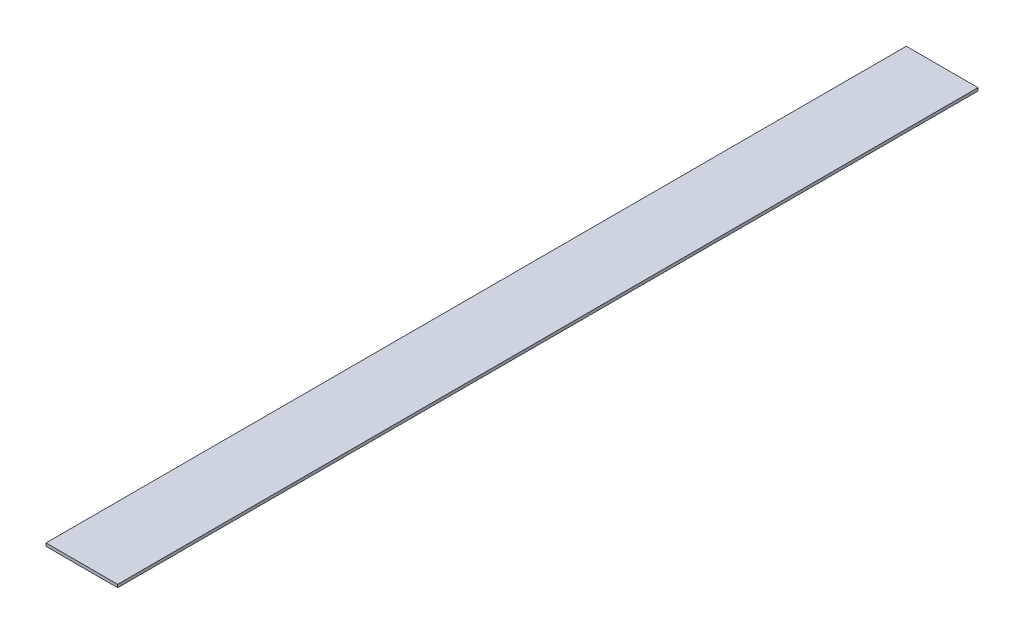
ISO-10303-21;
HEADER;
FILE_DESCRIPTION(('STEP AP214'),'2;1');
FILE_NAME('part.step','',(''),(''),'','','');
FILE_SCHEMA(('AUTOMOTIVE_DESIGN { 1 0 10303 214 1 1 1 1 }'));
ENDSEC;
DATA;
#1=APPLICATION_CONTEXT('core data for automotive mechanical design processes');
#2=APPLICATION_PROTOCOL_DEFINITION('international standard','automotive_design',2000,#1);
#3=PRODUCT_CONTEXT('',#1,'mechanical');
#4=PRODUCT('Part','Part','',(#3));
#5=PRODUCT_RELATED_PRODUCT_CATEGORY('part','',(#4));
#6=PRODUCT_DEFINITION_FORMATION('','',#4);
#7=PRODUCT_DEFINITION_CONTEXT('part definition',#1,'design');
#8=PRODUCT_DEFINITION('design','',#6,#7);
#9=PRODUCT_DEFINITION_SHAPE('','',#8);
#10=(LENGTH_UNIT() NAMED_UNIT(*) SI_UNIT(.MILLI.,.METRE.));
#11=(NAMED_UNIT(*) PLANE_ANGLE_UNIT() SI_UNIT($,.RADIAN.));
#12=(NAMED_UNIT(*) SI_UNIT($,.STERADIAN.) SOLID_ANGLE_UNIT());
#13=UNCERTAINTY_MEASURE_WITH_UNIT(LENGTH_MEASURE(1.E-05),#10,'distance_accuracy_value','');
#14=(GEOMETRIC_REPRESENTATION_CONTEXT(3) GLOBAL_UNCERTAINTY_ASSIGNED_CONTEXT((#13)) GLOBAL_UNIT_ASSIGNED_CONTEXT((#10,
#11,#12)) REPRESENTATION_CONTEXT('',''));
#15=CARTESIAN_POINT('',(0.,0.,0.));
#16=DIRECTION('',(0.,0.,1.));
#17=DIRECTION('',(1.,0.,0.));
#18=AXIS2_PLACEMENT_3D('',#15,#16,#17);
#19=CARTESIAN_POINT('',(0.,3.175,0.));
#20=DIRECTION('',(1.,0.,0.));
#21=DIRECTION('',(0.,0.,-1.));
#22=AXIS2_PLACEMENT_3D('',#19,#20,#21);
#23=PLANE('',#22);
#24=DIRECTION('',(0.,0.,1.));
#25=VECTOR('',#24,1.);
#26=CARTESIAN_POINT('',(0.,0.,0.));
#27=LINE('',#26,#25);
#28=CARTESIAN_POINT('',(0.,0.,-914.4));
#29=VERTEX_POINT('',#28);
#30=CARTESIAN_POINT('',(0.,0.,0.));
#31=VERTEX_POINT('',#30);
#32=EDGE_CURVE('E80',#29,#31,#27,.T.);
#33=ORIENTED_EDGE('',*,*,#32,.T.);
#34=DIRECTION('',(0.,-1.,0.));
#35=VECTOR('',#34,1.);
#36=CARTESIAN_POINT('',(0.,3.175,0.));
#37=LINE('',#36,#35);
#38=CARTESIAN_POINT('',(0.,3.175,0.));
#39=VERTEX_POINT('',#38);
#40=EDGE_CURVE('E11',#39,#31,#37,.T.);
#41=ORIENTED_EDGE('',*,*,#40,.F.);
#42=DIRECTION('',(0.,0.,1.));
#43=VECTOR('',#42,1.);
#44=CARTESIAN_POINT('',(0.,3.175,0.));
#45=LINE('',#44,#43);
#46=CARTESIAN_POINT('',(0.,3.175,-914.4));
#47=VERTEX_POINT('',#46);
#48=EDGE_CURVE('E68',#47,#39,#45,.T.);
#49=ORIENTED_EDGE('',*,*,#48,.F.);
#50=DIRECTION('',(0.,-1.,0.));
#51=VECTOR('',#50,1.);
#52=CARTESIAN_POINT('',(0.,3.175,-914.4));
#53=LINE('',#52,#51);
#54=EDGE_CURVE('E76',#47,#29,#53,.T.);
#55=ORIENTED_EDGE('',*,*,#54,.T.);
#56=EDGE_LOOP('',(#33,#41,#49,#55));
#57=FACE_BOUND('',#56,.T.);
#58=ADVANCED_FACE('F17',(#57),#23,.F.);
#59=CARTESIAN_POINT('',(0.,3.175,0.));
#60=DIRECTION('',(0.,0.,-1.));
#61=DIRECTION('',(-1.,0.,0.));
#62=AXIS2_PLACEMENT_3D('',#59,#60,#61);
#63=PLANE('',#62);
#64=DIRECTION('',(1.,0.,0.));
#65=VECTOR('',#64,1.);
#66=CARTESIAN_POINT('',(0.,0.,0.));
#67=LINE('',#66,#65);
#68=CARTESIAN_POINT('',(76.2,0.,0.));
#69=VERTEX_POINT('',#68);
#70=EDGE_CURVE('E72',#31,#69,#67,.T.);
#71=ORIENTED_EDGE('',*,*,#70,.T.);
#72=DIRECTION('',(0.,-1.,0.));
#73=VECTOR('',#72,1.);
#74=CARTESIAN_POINT('',(76.2,3.175,0.));
#75=LINE('',#74,#73);
#76=CARTESIAN_POINT('',(76.2,3.175,0.));
#77=VERTEX_POINT('',#76);
#78=EDGE_CURVE('E25',#77,#69,#75,.T.);
#79=ORIENTED_EDGE('',*,*,#78,.F.);
#80=DIRECTION('',(1.,0.,0.));
#81=VECTOR('',#80,1.);
#82=CARTESIAN_POINT('',(0.,3.175,0.));
#83=LINE('',#82,#81);
#84=EDGE_CURVE('E63',#39,#77,#83,.T.);
#85=ORIENTED_EDGE('',*,*,#84,.F.);
#86=ORIENTED_EDGE('',*,*,#40,.T.);
#87=EDGE_LOOP('',(#71,#79,#85,#86));
#88=FACE_BOUND('',#87,.T.);
#89=ADVANCED_FACE('F71',(#88),#63,.F.);
#90=CARTESIAN_POINT('',(76.2,3.175,0.));
#91=DIRECTION('',(-1.,0.,0.));
#92=DIRECTION('',(0.,0.,1.));
#93=AXIS2_PLACEMENT_3D('',#90,#91,#92);
#94=PLANE('',#93);
#95=DIRECTION('',(0.,0.,-1.));
#96=VECTOR('',#95,1.);
#97=CARTESIAN_POINT('',(76.2,0.,0.));
#98=LINE('',#97,#96);
#99=CARTESIAN_POINT('',(76.2,0.,-914.4));
#100=VERTEX_POINT('',#99);
#101=EDGE_CURVE('E50',#69,#100,#98,.T.);
#102=ORIENTED_EDGE('',*,*,#101,.T.);
#103=DIRECTION('',(0.,-1.,0.));
#104=VECTOR('',#103,1.);
#105=CARTESIAN_POINT('',(76.2,3.175,-914.4));
#106=LINE('',#105,#104);
#107=CARTESIAN_POINT('',(76.2,3.175,-914.4));
#108=VERTEX_POINT('',#107);
#109=EDGE_CURVE('E73',#108,#100,#106,.T.);
#110=ORIENTED_EDGE('',*,*,#109,.F.);
#111=DIRECTION('',(0.,0.,-1.));
#112=VECTOR('',#111,1.);
#113=CARTESIAN_POINT('',(76.2,3.175,0.));
#114=LINE('',#113,#112);
#115=EDGE_CURVE('E66',#77,#108,#114,.T.);
#116=ORIENTED_EDGE('',*,*,#115,.F.);
#117=ORIENTED_EDGE('',*,*,#78,.T.);
#118=EDGE_LOOP('',(#102,#110,#116,#117));
#119=FACE_BOUND('',#118,.T.);
#120=ADVANCED_FACE('F74',(#119),#94,.F.);
#121=CARTESIAN_POINT('',(0.,3.175,-914.4));
#122=DIRECTION('',(0.,0.,1.));
#123=DIRECTION('',(1.,0.,0.));
#124=AXIS2_PLACEMENT_3D('',#121,#122,#123);
#125=PLANE('',#124);
#126=DIRECTION('',(-1.,0.,0.));
#127=VECTOR('',#126,1.);
#128=CARTESIAN_POINT('',(0.,0.,-914.4));
#129=LINE('',#128,#127);
#130=EDGE_CURVE('E56',#100,#29,#129,.T.);
#131=ORIENTED_EDGE('',*,*,#130,.T.);
#132=ORIENTED_EDGE('',*,*,#54,.F.);
#133=DIRECTION('',(-1.,0.,0.));
#134=VECTOR('',#133,1.);
#135=CARTESIAN_POINT('',(0.,3.175,-914.4));
#136=LINE('',#135,#134);
#137=EDGE_CURVE('E33',#108,#47,#136,.T.);
#138=ORIENTED_EDGE('',*,*,#137,.F.);
#139=ORIENTED_EDGE('',*,*,#109,.T.);
#140=EDGE_LOOP('',(#131,#132,#138,#139));
#141=FACE_BOUND('',#140,.T.);
#142=ADVANCED_FACE('F87',(#141),#125,.F.);
#143=CARTESIAN_POINT('',(0.,3.175,-914.4));
#144=DIRECTION('',(0.,-1.,0.));
#145=DIRECTION('',(0.,0.,-1.));
#146=AXIS2_PLACEMENT_3D('',#143,#144,#145);
#147=PLANE('',#146);
#148=ORIENTED_EDGE('',*,*,#48,.T.);
#149=ORIENTED_EDGE('',*,*,#84,.T.);
#150=ORIENTED_EDGE('',*,*,#115,.T.);
#151=ORIENTED_EDGE('',*,*,#137,.T.);
#152=EDGE_LOOP('',(#148,#149,#150,#151));
#153=FACE_BOUND('',#152,.T.);
#154=ADVANCED_FACE('F64',(#153),#147,.F.);
#155=CARTESIAN_POINT('',(0.,0.,-914.4));
#156=DIRECTION('',(0.,-1.,0.));
#157=DIRECTION('',(0.,0.,-1.));
#158=AXIS2_PLACEMENT_3D('',#155,#156,#157);
#159=PLANE('',#158);
#160=ORIENTED_EDGE('',*,*,#32,.F.);
#161=ORIENTED_EDGE('',*,*,#130,.F.);
#162=ORIENTED_EDGE('',*,*,#101,.F.);
#163=ORIENTED_EDGE('',*,*,#70,.F.);
#164=EDGE_LOOP('',(#160,#161,#162,#163));
#165=FACE_BOUND('',#164,.T.);
#166=ADVANCED_FACE('F90',(#165),#159,.T.);
#167=CLOSED_SHELL('',(#58,#89,#120,#142,#154,#166));
#168=MANIFOLD_SOLID_BREP('B1',#167);
#169=ADVANCED_BREP_SHAPE_REPRESENTATION('',(#18,#168),#14);
#170=SHAPE_DEFINITION_REPRESENTATION(#9,#169);
ENDSEC;
END-ISO-10303-21;
